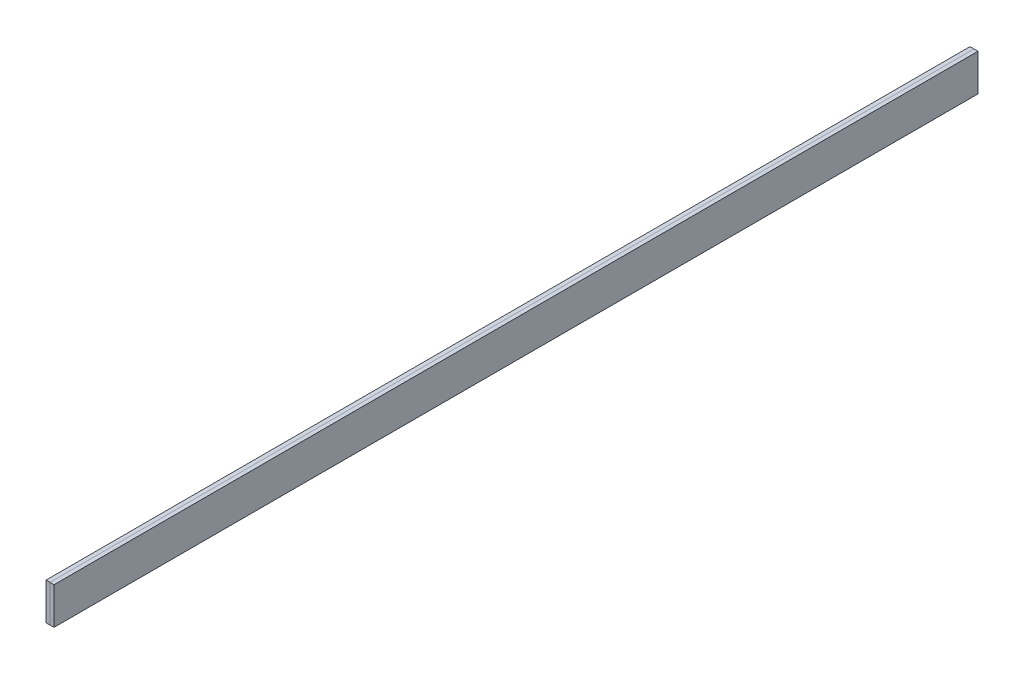
ISO-10303-21;
HEADER;
FILE_DESCRIPTION(('STEP AP214'),'2;1');
FILE_NAME('part.step','',(''),(''),'','','');
FILE_SCHEMA(('AUTOMOTIVE_DESIGN { 1 0 10303 214 1 1 1 1 }'));
ENDSEC;
DATA;
#1=APPLICATION_CONTEXT('core data for automotive mechanical design processes');
#2=APPLICATION_PROTOCOL_DEFINITION('international standard','automotive_design',2000,#1);
#3=PRODUCT_CONTEXT('',#1,'mechanical');
#4=PRODUCT('Part','Part','',(#3));
#5=PRODUCT_RELATED_PRODUCT_CATEGORY('part','',(#4));
#6=PRODUCT_DEFINITION_FORMATION('','',#4);
#7=PRODUCT_DEFINITION_CONTEXT('part definition',#1,'design');
#8=PRODUCT_DEFINITION('design','',#6,#7);
#9=PRODUCT_DEFINITION_SHAPE('','',#8);
#10=(LENGTH_UNIT() NAMED_UNIT(*) SI_UNIT(.MILLI.,.METRE.));
#11=(NAMED_UNIT(*) PLANE_ANGLE_UNIT() SI_UNIT($,.RADIAN.));
#12=(NAMED_UNIT(*) SI_UNIT($,.STERADIAN.) SOLID_ANGLE_UNIT());
#13=UNCERTAINTY_MEASURE_WITH_UNIT(LENGTH_MEASURE(1.E-05),#10,'distance_accuracy_value','');
#14=(GEOMETRIC_REPRESENTATION_CONTEXT(3) GLOBAL_UNCERTAINTY_ASSIGNED_CONTEXT((#13)) GLOBAL_UNIT_ASSIGNED_CONTEXT((#10,
#11,#12)) REPRESENTATION_CONTEXT('',''));
#15=CARTESIAN_POINT('',(0.,0.,0.));
#16=DIRECTION('',(0.,0.,1.));
#17=DIRECTION('',(1.,0.,0.));
#18=AXIS2_PLACEMENT_3D('',#15,#16,#17);
#19=CARTESIAN_POINT('',(0.,0.,150.));
#20=DIRECTION('',(1.,0.,0.));
#21=DIRECTION('',(0.,0.,1.));
#22=AXIS2_PLACEMENT_3D('',#19,#20,#21);
#23=PLANE('',#22);
#24=DIRECTION('',(0.,1.,0.));
#25=VECTOR('',#24,1.);
#26=CARTESIAN_POINT('',(0.,0.,0.));
#27=LINE('',#26,#25);
#28=CARTESIAN_POINT('',(0.,0.,0.));
#29=VERTEX_POINT('',#28);
#30=CARTESIAN_POINT('',(0.,6.,0.));
#31=VERTEX_POINT('',#30);
#32=EDGE_CURVE('E129',#29,#31,#27,.T.);
#33=ORIENTED_EDGE('',*,*,#32,.F.);
#34=DIRECTION('',(0.,0.,-1.));
#35=VECTOR('',#34,1.);
#36=CARTESIAN_POINT('',(0.,0.,150.));
#37=LINE('',#36,#35);
#38=CARTESIAN_POINT('',(0.,0.,150.));
#39=VERTEX_POINT('',#38);
#40=EDGE_CURVE('E128',#39,#29,#37,.T.);
#41=ORIENTED_EDGE('',*,*,#40,.F.);
#42=DIRECTION('',(0.,1.,0.));
#43=VECTOR('',#42,1.);
#44=CARTESIAN_POINT('',(0.,0.,150.));
#45=LINE('',#44,#43);
#46=CARTESIAN_POINT('',(0.,6.,150.));
#47=VERTEX_POINT('',#46);
#48=EDGE_CURVE('E121',#39,#47,#45,.T.);
#49=ORIENTED_EDGE('',*,*,#48,.T.);
#50=DIRECTION('',(0.,0.,-1.));
#51=VECTOR('',#50,1.);
#52=CARTESIAN_POINT('',(0.,6.,150.));
#53=LINE('',#52,#51);
#54=EDGE_CURVE('E12',#47,#31,#53,.T.);
#55=ORIENTED_EDGE('',*,*,#54,.T.);
#56=EDGE_LOOP('',(#33,#41,#49,#55));
#57=FACE_BOUND('',#56,.T.);
#58=ADVANCED_FACE('F52',(#57),#23,.F.);
#59=CARTESIAN_POINT('',(0.,6.,150.));
#60=DIRECTION('',(0.,-1.,0.));
#61=DIRECTION('',(0.,0.,-1.));
#62=AXIS2_PLACEMENT_3D('',#59,#60,#61);
#63=PLANE('',#62);
#64=DIRECTION('',(1.,0.,0.));
#65=VECTOR('',#64,1.);
#66=CARTESIAN_POINT('',(0.,6.,0.));
#67=LINE('',#66,#65);
#68=CARTESIAN_POINT('',(0.650000000000001,6.,0.));
#69=VERTEX_POINT('',#68);
#70=EDGE_CURVE('E132',#31,#69,#67,.T.);
#71=ORIENTED_EDGE('',*,*,#70,.F.);
#72=ORIENTED_EDGE('',*,*,#54,.F.);
#73=DIRECTION('',(1.,0.,0.));
#74=VECTOR('',#73,1.);
#75=CARTESIAN_POINT('',(0.,6.,150.));
#76=LINE('',#75,#74);
#77=CARTESIAN_POINT('',(0.650000000000001,6.,150.));
#78=VERTEX_POINT('',#77);
#79=EDGE_CURVE('E101',#47,#78,#76,.T.);
#80=ORIENTED_EDGE('',*,*,#79,.T.);
#81=DIRECTION('',(0.,0.,-1.));
#82=VECTOR('',#81,1.);
#83=CARTESIAN_POINT('',(0.650000000000001,6.,150.));
#84=LINE('',#83,#82);
#85=EDGE_CURVE('E61',#78,#69,#84,.T.);
#86=ORIENTED_EDGE('',*,*,#85,.T.);
#87=EDGE_LOOP('',(#71,#72,#80,#86));
#88=FACE_BOUND('',#87,.T.);
#89=ADVANCED_FACE('F118',(#88),#63,.F.);
#90=CARTESIAN_POINT('',(0.65,0.,150.));
#91=DIRECTION('',(-1.,0.,0.));
#92=DIRECTION('',(0.,1.,0.));
#93=AXIS2_PLACEMENT_3D('',#90,#91,#92);
#94=PLANE('',#93);
#95=DIRECTION('',(0.,-1.,0.));
#96=VECTOR('',#95,1.);
#97=CARTESIAN_POINT('',(0.65,0.,0.));
#98=LINE('',#97,#96);
#99=CARTESIAN_POINT('',(0.65,0.,0.));
#100=VERTEX_POINT('',#99);
#101=EDGE_CURVE('E113',#69,#100,#98,.T.);
#102=ORIENTED_EDGE('',*,*,#101,.F.);
#103=ORIENTED_EDGE('',*,*,#85,.F.);
#104=DIRECTION('',(0.,-1.,0.));
#105=VECTOR('',#104,1.);
#106=CARTESIAN_POINT('',(0.65,0.,150.));
#107=LINE('',#106,#105);
#108=CARTESIAN_POINT('',(0.65,0.,150.));
#109=VERTEX_POINT('',#108);
#110=EDGE_CURVE('E105',#78,#109,#107,.T.);
#111=ORIENTED_EDGE('',*,*,#110,.T.);
#112=DIRECTION('',(0.,0.,-1.));
#113=VECTOR('',#112,1.);
#114=CARTESIAN_POINT('',(0.65,0.,150.));
#115=LINE('',#114,#113);
#116=EDGE_CURVE('E117',#109,#100,#115,.T.);
#117=ORIENTED_EDGE('',*,*,#116,.T.);
#118=EDGE_LOOP('',(#102,#103,#111,#117));
#119=FACE_BOUND('',#118,.T.);
#120=ADVANCED_FACE('F112',(#119),#94,.F.);
#121=CARTESIAN_POINT('',(0.,0.,150.));
#122=DIRECTION('',(0.,1.,0.));
#123=DIRECTION('',(0.,0.,1.));
#124=AXIS2_PLACEMENT_3D('',#121,#122,#123);
#125=PLANE('',#124);
#126=DIRECTION('',(-1.,0.,0.));
#127=VECTOR('',#126,1.);
#128=CARTESIAN_POINT('',(0.,0.,0.));
#129=LINE('',#128,#127);
#130=EDGE_CURVE('E90',#100,#29,#129,.T.);
#131=ORIENTED_EDGE('',*,*,#130,.F.);
#132=ORIENTED_EDGE('',*,*,#116,.F.);
#133=DIRECTION('',(-1.,0.,0.));
#134=VECTOR('',#133,1.);
#135=CARTESIAN_POINT('',(0.,0.,150.));
#136=LINE('',#135,#134);
#137=EDGE_CURVE('E72',#109,#39,#136,.T.);
#138=ORIENTED_EDGE('',*,*,#137,.T.);
#139=ORIENTED_EDGE('',*,*,#40,.T.);
#140=EDGE_LOOP('',(#131,#132,#138,#139));
#141=FACE_BOUND('',#140,.T.);
#142=ADVANCED_FACE('F146',(#141),#125,.F.);
#143=CARTESIAN_POINT('',(0.,0.,150.));
#144=DIRECTION('',(0.,0.,1.));
#145=DIRECTION('',(-1.,0.,0.));
#146=AXIS2_PLACEMENT_3D('',#143,#144,#145);
#147=PLANE('',#146);
#148=ORIENTED_EDGE('',*,*,#48,.F.);
#149=ORIENTED_EDGE('',*,*,#137,.F.);
#150=ORIENTED_EDGE('',*,*,#110,.F.);
#151=ORIENTED_EDGE('',*,*,#79,.F.);
#152=EDGE_LOOP('',(#148,#149,#150,#151));
#153=FACE_BOUND('',#152,.T.);
#154=ADVANCED_FACE('F107',(#153),#147,.T.);
#155=CARTESIAN_POINT('',(0.,0.,0.));
#156=DIRECTION('',(0.,0.,1.));
#157=DIRECTION('',(-1.,0.,0.));
#158=AXIS2_PLACEMENT_3D('',#155,#156,#157);
#159=PLANE('',#158);
#160=ORIENTED_EDGE('',*,*,#32,.T.);
#161=ORIENTED_EDGE('',*,*,#70,.T.);
#162=ORIENTED_EDGE('',*,*,#101,.T.);
#163=ORIENTED_EDGE('',*,*,#130,.T.);
#164=EDGE_LOOP('',(#160,#161,#162,#163));
#165=FACE_BOUND('',#164,.T.);
#166=ADVANCED_FACE('F142',(#165),#159,.F.);
#167=CLOSED_SHELL('',(#58,#89,#120,#142,#154,#166));
#168=MANIFOLD_SOLID_BREP('B2',#167);
#169=CARTESIAN_POINT('',(0.,0.,150.));
#170=DIRECTION('',(-1.,0.,0.));
#171=DIRECTION('',(0.,0.,1.));
#172=AXIS2_PLACEMENT_3D('',#169,#170,#171);
#173=PLANE('',#172);
#174=DIRECTION('',(0.,1.,0.));
#175=VECTOR('',#174,1.);
#176=CARTESIAN_POINT('',(0.,0.,0.));
#177=LINE('',#176,#175);
#178=CARTESIAN_POINT('',(0.,0.,0.));
#179=VERTEX_POINT('',#178);
#180=CARTESIAN_POINT('',(0.,6.,0.));
#181=VERTEX_POINT('',#180);
#182=EDGE_CURVE('E302',#179,#181,#177,.T.);
#183=ORIENTED_EDGE('',*,*,#182,.T.);
#184=DIRECTION('',(0.,0.,-1.));
#185=VECTOR('',#184,1.);
#186=CARTESIAN_POINT('',(0.,6.,150.));
#187=LINE('',#186,#185);
#188=CARTESIAN_POINT('',(0.,6.,150.));
#189=VERTEX_POINT('',#188);
#190=EDGE_CURVE('E50',#189,#181,#187,.T.);
#191=ORIENTED_EDGE('',*,*,#190,.F.);
#192=DIRECTION('',(0.,1.,0.));
#193=VECTOR('',#192,1.);
#194=CARTESIAN_POINT('',(0.,0.,150.));
#195=LINE('',#194,#193);
#196=CARTESIAN_POINT('',(0.,0.,150.));
#197=VERTEX_POINT('',#196);
#198=EDGE_CURVE('E286',#197,#189,#195,.T.);
#199=ORIENTED_EDGE('',*,*,#198,.F.);
#200=DIRECTION('',(0.,0.,-1.));
#201=VECTOR('',#200,1.);
#202=CARTESIAN_POINT('',(0.,0.,150.));
#203=LINE('',#202,#201);
#204=EDGE_CURVE('E298',#197,#179,#203,.T.);
#205=ORIENTED_EDGE('',*,*,#204,.T.);
#206=EDGE_LOOP('',(#183,#191,#199,#205));
#207=FACE_BOUND('',#206,.T.);
#208=ADVANCED_FACE('F226',(#207),#173,.F.);
#209=CARTESIAN_POINT('',(0.,6.,150.));
#210=DIRECTION('',(0.,-1.,0.));
#211=DIRECTION('',(0.,0.,-1.));
#212=AXIS2_PLACEMENT_3D('',#209,#210,#211);
#213=PLANE('',#212);
#214=DIRECTION('',(-1.,0.,0.));
#215=VECTOR('',#214,1.);
#216=CARTESIAN_POINT('',(0.,6.,0.));
#217=LINE('',#216,#215);
#218=CARTESIAN_POINT('',(-0.650000000000001,6.,0.));
#219=VERTEX_POINT('',#218);
#220=EDGE_CURVE('E291',#181,#219,#217,.T.);
#221=ORIENTED_EDGE('',*,*,#220,.T.);
#222=DIRECTION('',(0.,0.,-1.));
#223=VECTOR('',#222,1.);
#224=CARTESIAN_POINT('',(-0.650000000000001,6.,150.));
#225=LINE('',#224,#223);
#226=CARTESIAN_POINT('',(-0.650000000000001,6.,150.));
#227=VERTEX_POINT('',#226);
#228=EDGE_CURVE('E235',#227,#219,#225,.T.);
#229=ORIENTED_EDGE('',*,*,#228,.F.);
#230=DIRECTION('',(-1.,0.,0.));
#231=VECTOR('',#230,1.);
#232=CARTESIAN_POINT('',(0.,6.,150.));
#233=LINE('',#232,#231);
#234=EDGE_CURVE('E281',#189,#227,#233,.T.);
#235=ORIENTED_EDGE('',*,*,#234,.F.);
#236=ORIENTED_EDGE('',*,*,#190,.T.);
#237=EDGE_LOOP('',(#221,#229,#235,#236));
#238=FACE_BOUND('',#237,.T.);
#239=ADVANCED_FACE('F290',(#238),#213,.F.);
#240=CARTESIAN_POINT('',(-0.65,0.,150.));
#241=DIRECTION('',(1.,0.,0.));
#242=DIRECTION('',(0.,1.,0.));
#243=AXIS2_PLACEMENT_3D('',#240,#241,#242);
#244=PLANE('',#243);
#245=DIRECTION('',(0.,-1.,0.));
#246=VECTOR('',#245,1.);
#247=CARTESIAN_POINT('',(-0.65,0.,0.));
#248=LINE('',#247,#246);
#249=CARTESIAN_POINT('',(-0.65,0.,0.));
#250=VERTEX_POINT('',#249);
#251=EDGE_CURVE('E267',#219,#250,#248,.T.);
#252=ORIENTED_EDGE('',*,*,#251,.T.);
#253=DIRECTION('',(0.,0.,-1.));
#254=VECTOR('',#253,1.);
#255=CARTESIAN_POINT('',(-0.65,0.,150.));
#256=LINE('',#255,#254);
#257=CARTESIAN_POINT('',(-0.65,0.,150.));
#258=VERTEX_POINT('',#257);
#259=EDGE_CURVE('E293',#258,#250,#256,.T.);
#260=ORIENTED_EDGE('',*,*,#259,.F.);
#261=DIRECTION('',(0.,-1.,0.));
#262=VECTOR('',#261,1.);
#263=CARTESIAN_POINT('',(-0.65,0.,150.));
#264=LINE('',#263,#262);
#265=EDGE_CURVE('E284',#227,#258,#264,.T.);
#266=ORIENTED_EDGE('',*,*,#265,.F.);
#267=ORIENTED_EDGE('',*,*,#228,.T.);
#268=EDGE_LOOP('',(#252,#260,#266,#267));
#269=FACE_BOUND('',#268,.T.);
#270=ADVANCED_FACE('F294',(#269),#244,.F.);
#271=CARTESIAN_POINT('',(0.,0.,150.));
#272=DIRECTION('',(0.,1.,0.));
#273=DIRECTION('',(0.,0.,1.));
#274=AXIS2_PLACEMENT_3D('',#271,#272,#273);
#275=PLANE('',#274);
#276=DIRECTION('',(1.,0.,0.));
#277=VECTOR('',#276,1.);
#278=CARTESIAN_POINT('',(0.,0.,0.));
#279=LINE('',#278,#277);
#280=EDGE_CURVE('E273',#250,#179,#279,.T.);
#281=ORIENTED_EDGE('',*,*,#280,.T.);
#282=ORIENTED_EDGE('',*,*,#204,.F.);
#283=DIRECTION('',(1.,0.,0.));
#284=VECTOR('',#283,1.);
#285=CARTESIAN_POINT('',(0.,0.,150.));
#286=LINE('',#285,#284);
#287=EDGE_CURVE('E246',#258,#197,#286,.T.);
#288=ORIENTED_EDGE('',*,*,#287,.F.);
#289=ORIENTED_EDGE('',*,*,#259,.T.);
#290=EDGE_LOOP('',(#281,#282,#288,#289));
#291=FACE_BOUND('',#290,.T.);
#292=ADVANCED_FACE('F316',(#291),#275,.F.);
#293=CARTESIAN_POINT('',(0.,0.,150.));
#294=DIRECTION('',(0.,0.,1.));
#295=DIRECTION('',(1.,0.,0.));
#296=AXIS2_PLACEMENT_3D('',#293,#294,#295);
#297=PLANE('',#296);
#298=ORIENTED_EDGE('',*,*,#198,.T.);
#299=ORIENTED_EDGE('',*,*,#234,.T.);
#300=ORIENTED_EDGE('',*,*,#265,.T.);
#301=ORIENTED_EDGE('',*,*,#287,.T.);
#302=EDGE_LOOP('',(#298,#299,#300,#301));
#303=FACE_BOUND('',#302,.T.);
#304=ADVANCED_FACE('F282',(#303),#297,.T.);
#305=CARTESIAN_POINT('',(0.,0.,0.));
#306=DIRECTION('',(0.,0.,1.));
#307=DIRECTION('',(1.,0.,0.));
#308=AXIS2_PLACEMENT_3D('',#305,#306,#307);
#309=PLANE('',#308);
#310=ORIENTED_EDGE('',*,*,#182,.F.);
#311=ORIENTED_EDGE('',*,*,#280,.F.);
#312=ORIENTED_EDGE('',*,*,#251,.F.);
#313=ORIENTED_EDGE('',*,*,#220,.F.);
#314=EDGE_LOOP('',(#310,#311,#312,#313));
#315=FACE_BOUND('',#314,.T.);
#316=ADVANCED_FACE('F319',(#315),#309,.F.);
#317=CLOSED_SHELL('',(#208,#239,#270,#292,#304,#316));
#318=MANIFOLD_SOLID_BREP('B6',#317);
#319=ADVANCED_BREP_SHAPE_REPRESENTATION('',(#18,#168,#318),#14);
#320=SHAPE_DEFINITION_REPRESENTATION(#9,#319);
ENDSEC;
END-ISO-10303-21;
